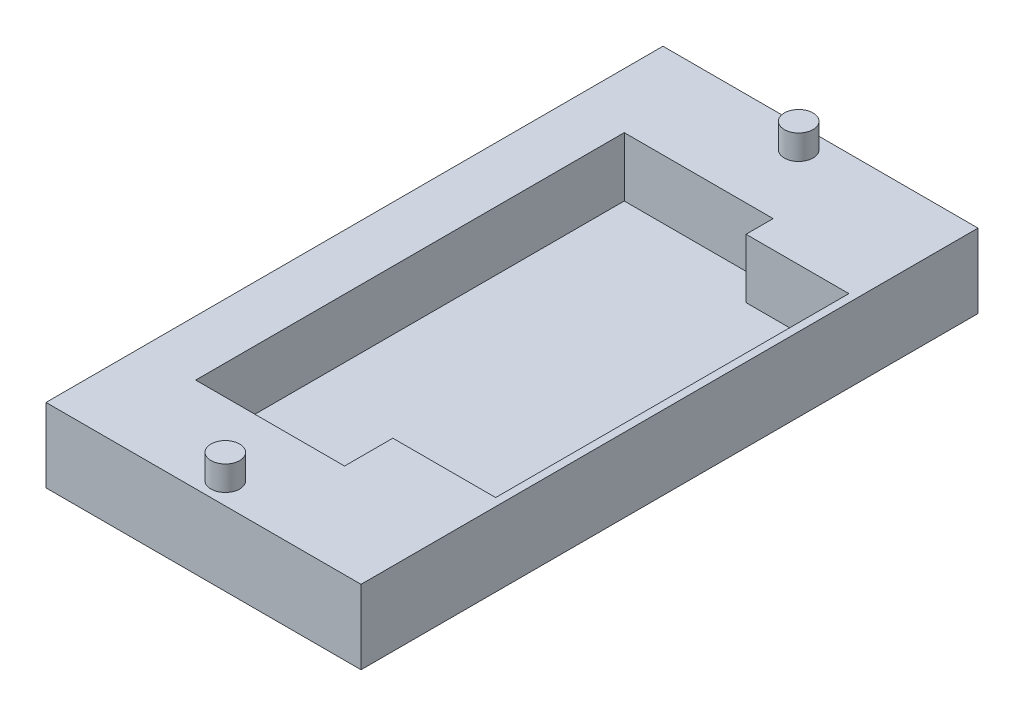
ISO-10303-21;
HEADER;
FILE_DESCRIPTION(('STEP AP214'),'2;1');
FILE_NAME('part.step','',(''),(''),'','','');
FILE_SCHEMA(('AUTOMOTIVE_DESIGN { 1 0 10303 214 1 1 1 1 }'));
ENDSEC;
DATA;
#1=APPLICATION_CONTEXT('core data for automotive mechanical design processes');
#2=APPLICATION_PROTOCOL_DEFINITION('international standard','automotive_design',2000,#1);
#3=PRODUCT_CONTEXT('',#1,'mechanical');
#4=PRODUCT('Part','Part','',(#3));
#5=PRODUCT_RELATED_PRODUCT_CATEGORY('part','',(#4));
#6=PRODUCT_DEFINITION_FORMATION('','',#4);
#7=PRODUCT_DEFINITION_CONTEXT('part definition',#1,'design');
#8=PRODUCT_DEFINITION('design','',#6,#7);
#9=PRODUCT_DEFINITION_SHAPE('','',#8);
#10=(LENGTH_UNIT() NAMED_UNIT(*) SI_UNIT(.MILLI.,.METRE.));
#11=(NAMED_UNIT(*) PLANE_ANGLE_UNIT() SI_UNIT($,.RADIAN.));
#12=(NAMED_UNIT(*) SI_UNIT($,.STERADIAN.) SOLID_ANGLE_UNIT());
#13=UNCERTAINTY_MEASURE_WITH_UNIT(LENGTH_MEASURE(1.E-05),#10,'distance_accuracy_value','');
#14=(GEOMETRIC_REPRESENTATION_CONTEXT(3) GLOBAL_UNCERTAINTY_ASSIGNED_CONTEXT((#13)) GLOBAL_UNIT_ASSIGNED_CONTEXT((#10,
#11,#12)) REPRESENTATION_CONTEXT('',''));
#15=CARTESIAN_POINT('',(0.,0.,0.));
#16=DIRECTION('',(0.,0.,1.));
#17=DIRECTION('',(1.,0.,0.));
#18=AXIS2_PLACEMENT_3D('',#15,#16,#17);
#19=CARTESIAN_POINT('',(22.5,9.,37.5));
#20=DIRECTION('',(0.,0.,-1.));
#21=DIRECTION('',(-1.,0.,0.));
#22=AXIS2_PLACEMENT_3D('',#19,#20,#21);
#23=PLANE('',#22);
#24=DIRECTION('',(1.,0.,0.));
#25=VECTOR('',#24,1.);
#26=CARTESIAN_POINT('',(22.5,9.,37.5));
#27=LINE('',#26,#25);
#28=CARTESIAN_POINT('',(-15.79562908,9.,37.5));
#29=VERTEX_POINT('',#28);
#30=CARTESIAN_POINT('',(22.5,9.,37.5));
#31=VERTEX_POINT('',#30);
#32=EDGE_CURVE('E133',#29,#31,#27,.T.);
#33=ORIENTED_EDGE('',*,*,#32,.F.);
#34=DIRECTION('',(0.,1.,0.));
#35=VECTOR('',#34,1.);
#36=CARTESIAN_POINT('',(-15.79562908,0.,37.5));
#37=LINE('',#36,#35);
#38=CARTESIAN_POINT('',(-15.79562908,0.,37.5));
#39=VERTEX_POINT('',#38);
#40=EDGE_CURVE('E120',#39,#29,#37,.T.);
#41=ORIENTED_EDGE('',*,*,#40,.F.);
#42=DIRECTION('',(1.,0.,0.));
#43=VECTOR('',#42,1.);
#44=CARTESIAN_POINT('',(22.5,0.,37.5));
#45=LINE('',#44,#43);
#46=CARTESIAN_POINT('',(22.5,0.,37.5));
#47=VERTEX_POINT('',#46);
#48=EDGE_CURVE('E131',#39,#47,#45,.T.);
#49=ORIENTED_EDGE('',*,*,#48,.T.);
#50=DIRECTION('',(0.,-1.,0.));
#51=VECTOR('',#50,1.);
#52=CARTESIAN_POINT('',(22.5,9.,37.5));
#53=LINE('',#52,#51);
#54=EDGE_CURVE('E152',#31,#47,#53,.T.);
#55=ORIENTED_EDGE('',*,*,#54,.F.);
#56=EDGE_LOOP('',(#33,#41,#49,#55));
#57=FACE_BOUND('',#56,.T.);
#58=ADVANCED_FACE('F32',(#57),#23,.F.);
#59=CARTESIAN_POINT('',(22.5,9.,-37.5));
#60=DIRECTION('',(-1.,0.,0.));
#61=DIRECTION('',(0.,0.,1.));
#62=AXIS2_PLACEMENT_3D('',#59,#60,#61);
#63=PLANE('',#62);
#64=DIRECTION('',(0.,0.,-1.));
#65=VECTOR('',#64,1.);
#66=CARTESIAN_POINT('',(22.5,0.,-37.5));
#67=LINE('',#66,#65);
#68=CARTESIAN_POINT('',(22.5,0.,-37.5));
#69=VERTEX_POINT('',#68);
#70=EDGE_CURVE('E137',#47,#69,#67,.T.);
#71=ORIENTED_EDGE('',*,*,#70,.T.);
#72=DIRECTION('',(0.,-1.,0.));
#73=VECTOR('',#72,1.);
#74=CARTESIAN_POINT('',(22.5,9.,-37.5));
#75=LINE('',#74,#73);
#76=CARTESIAN_POINT('',(22.5,9.,-37.5));
#77=VERTEX_POINT('',#76);
#78=EDGE_CURVE('E149',#77,#69,#75,.T.);
#79=ORIENTED_EDGE('',*,*,#78,.F.);
#80=DIRECTION('',(0.,0.,-1.));
#81=VECTOR('',#80,1.);
#82=CARTESIAN_POINT('',(22.5,9.,-37.5));
#83=LINE('',#82,#81);
#84=EDGE_CURVE('E172',#31,#77,#83,.T.);
#85=ORIENTED_EDGE('',*,*,#84,.F.);
#86=ORIENTED_EDGE('',*,*,#54,.T.);
#87=EDGE_LOOP('',(#71,#79,#85,#86));
#88=FACE_BOUND('',#87,.T.);
#89=ADVANCED_FACE('F250',(#88),#63,.F.);
#90=CARTESIAN_POINT('',(22.5,9.,-37.5));
#91=DIRECTION('',(0.,0.,1.));
#92=DIRECTION('',(1.,0.,0.));
#93=AXIS2_PLACEMENT_3D('',#90,#91,#92);
#94=PLANE('',#93);
#95=DIRECTION('',(-1.,0.,0.));
#96=VECTOR('',#95,1.);
#97=CARTESIAN_POINT('',(22.5,0.,-37.5));
#98=LINE('',#97,#96);
#99=CARTESIAN_POINT('',(-15.79562908,0.,-37.5));
#100=VERTEX_POINT('',#99);
#101=EDGE_CURVE('E140',#69,#100,#98,.T.);
#102=ORIENTED_EDGE('',*,*,#101,.T.);
#103=DIRECTION('',(0.,1.,0.));
#104=VECTOR('',#103,1.);
#105=CARTESIAN_POINT('',(-15.79562908,0.,-37.5));
#106=LINE('',#105,#104);
#107=CARTESIAN_POINT('',(-15.79562908,9.,-37.5));
#108=VERTEX_POINT('',#107);
#109=EDGE_CURVE('E46',#100,#108,#106,.T.);
#110=ORIENTED_EDGE('',*,*,#109,.T.);
#111=DIRECTION('',(-1.,0.,0.));
#112=VECTOR('',#111,1.);
#113=CARTESIAN_POINT('',(22.5,9.,-37.5));
#114=LINE('',#113,#112);
#115=EDGE_CURVE('E145',#77,#108,#114,.T.);
#116=ORIENTED_EDGE('',*,*,#115,.F.);
#117=ORIENTED_EDGE('',*,*,#78,.T.);
#118=EDGE_LOOP('',(#102,#110,#116,#117));
#119=FACE_BOUND('',#118,.T.);
#120=ADVANCED_FACE('F161',(#119),#94,.F.);
#121=CARTESIAN_POINT('',(0.,9.,0.));
#122=DIRECTION('',(0.,-1.,0.));
#123=DIRECTION('',(0.,0.,-1.));
#124=AXIS2_PLACEMENT_3D('',#121,#122,#123);
#125=PLANE('',#124);
#126=CARTESIAN_POINT('',(3.35218546000001,9.,-34.85));
#127=DIRECTION('',(0.,-1.,0.));
#128=DIRECTION('',(0.,0.,-1.));
#129=AXIS2_PLACEMENT_3D('',#126,#127,#128);
#130=CIRCLE('',#129,1.75);
#131=CARTESIAN_POINT('',(3.35218546000001,9.,-36.6));
#132=VERTEX_POINT('',#131);
#133=EDGE_CURVE('E11',#132,#132,#130,.F.);
#134=ORIENTED_EDGE('',*,*,#133,.F.);
#135=EDGE_LOOP('',(#134));
#136=FACE_BOUND('',#135,.T.);
#137=CARTESIAN_POINT('',(3.35218546000001,9.,34.85));
#138=DIRECTION('',(0.,-1.,0.));
#139=DIRECTION('',(0.,0.,-1.));
#140=AXIS2_PLACEMENT_3D('',#137,#138,#139);
#141=CIRCLE('',#140,1.745);
#142=CARTESIAN_POINT('',(3.35218546000001,9.,33.105));
#143=VERTEX_POINT('',#142);
#144=EDGE_CURVE('E39',#143,#143,#141,.F.);
#145=ORIENTED_EDGE('',*,*,#144,.F.);
#146=EDGE_LOOP('',(#145));
#147=FACE_BOUND('',#146,.T.);
#148=DIRECTION('',(0.,0.,1.));
#149=VECTOR('',#148,1.);
#150=CARTESIAN_POINT('',(-9.05,9.,0.));
#151=LINE('',#150,#149);
#152=CARTESIAN_POINT('',(-9.05,9.,-26.05));
#153=VERTEX_POINT('',#152);
#154=CARTESIAN_POINT('',(-9.05,9.,26.05));
#155=VERTEX_POINT('',#154);
#156=EDGE_CURVE('E168',#153,#155,#151,.T.);
#157=ORIENTED_EDGE('',*,*,#156,.F.);
#158=DIRECTION('',(-1.,0.,0.));
#159=VECTOR('',#158,1.);
#160=CARTESIAN_POINT('',(0.,9.,-26.05));
#161=LINE('',#160,#159);
#162=CARTESIAN_POINT('',(9.05,9.,-26.05));
#163=VERTEX_POINT('',#162);
#164=EDGE_CURVE('E54',#163,#153,#161,.T.);
#165=ORIENTED_EDGE('',*,*,#164,.F.);
#166=DIRECTION('',(0.,0.,1.));
#167=VECTOR('',#166,1.);
#168=CARTESIAN_POINT('',(9.05,9.,0.));
#169=LINE('',#168,#167);
#170=CARTESIAN_POINT('',(9.05,9.,-22.7544100936888));
#171=VERTEX_POINT('',#170);
#172=EDGE_CURVE('E194',#163,#171,#169,.T.);
#173=ORIENTED_EDGE('',*,*,#172,.T.);
#174=DIRECTION('',(1.,0.,0.));
#175=VECTOR('',#174,1.);
#176=CARTESIAN_POINT('',(0.,9.,-22.7544100936888));
#177=LINE('',#176,#175);
#178=CARTESIAN_POINT('',(21.55,9.,-22.7544100936888));
#179=VERTEX_POINT('',#178);
#180=EDGE_CURVE('E191',#171,#179,#177,.T.);
#181=ORIENTED_EDGE('',*,*,#180,.T.);
#182=DIRECTION('',(0.,0.,1.));
#183=VECTOR('',#182,1.);
#184=CARTESIAN_POINT('',(21.55,9.,0.));
#185=LINE('',#184,#183);
#186=CARTESIAN_POINT('',(21.55,9.,20.1845414113188));
#187=VERTEX_POINT('',#186);
#188=EDGE_CURVE('E195',#179,#187,#185,.T.);
#189=ORIENTED_EDGE('',*,*,#188,.T.);
#190=DIRECTION('',(1.,0.,0.));
#191=VECTOR('',#190,1.);
#192=CARTESIAN_POINT('',(0.,9.,20.1845414113188));
#193=LINE('',#192,#191);
#194=CARTESIAN_POINT('',(9.05000000000001,9.,20.1845414113188));
#195=VERTEX_POINT('',#194);
#196=EDGE_CURVE('E198',#195,#187,#193,.T.);
#197=ORIENTED_EDGE('',*,*,#196,.F.);
#198=CARTESIAN_POINT('',(9.05000000000001,9.,26.05));
#199=VERTEX_POINT('',#198);
#200=EDGE_CURVE('E201',#195,#199,#169,.T.);
#201=ORIENTED_EDGE('',*,*,#200,.T.);
#202=DIRECTION('',(-1.,0.,0.));
#203=VECTOR('',#202,1.);
#204=CARTESIAN_POINT('',(0.,9.,26.05));
#205=LINE('',#204,#203);
#206=EDGE_CURVE('E204',#199,#155,#205,.T.);
#207=ORIENTED_EDGE('',*,*,#206,.T.);
#208=EDGE_LOOP('',(#157,#165,#173,#181,#189,#197,#201,#207));
#209=FACE_BOUND('',#208,.T.);
#210=ORIENTED_EDGE('',*,*,#115,.T.);
#211=DIRECTION('',(0.,0.,-1.));
#212=VECTOR('',#211,1.);
#213=CARTESIAN_POINT('',(-15.79562908,9.,-37.5));
#214=LINE('',#213,#212);
#215=EDGE_CURVE('E126',#29,#108,#214,.T.);
#216=ORIENTED_EDGE('',*,*,#215,.F.);
#217=ORIENTED_EDGE('',*,*,#32,.T.);
#218=ORIENTED_EDGE('',*,*,#84,.T.);
#219=EDGE_LOOP('',(#210,#216,#217,#218));
#220=FACE_BOUND('',#219,.T.);
#221=ADVANCED_FACE('F158',(#136,#147,#209,#220),#125,.F.);
#222=CARTESIAN_POINT('',(0.,0.,0.));
#223=DIRECTION('',(0.,-1.,0.));
#224=DIRECTION('',(0.,0.,-1.));
#225=AXIS2_PLACEMENT_3D('',#222,#223,#224);
#226=PLANE('',#225);
#227=DIRECTION('',(0.,0.,-1.));
#228=VECTOR('',#227,1.);
#229=CARTESIAN_POINT('',(-15.79562908,0.,-37.5));
#230=LINE('',#229,#228);
#231=EDGE_CURVE('E117',#39,#100,#230,.T.);
#232=ORIENTED_EDGE('',*,*,#231,.T.);
#233=ORIENTED_EDGE('',*,*,#101,.F.);
#234=ORIENTED_EDGE('',*,*,#70,.F.);
#235=ORIENTED_EDGE('',*,*,#48,.F.);
#236=EDGE_LOOP('',(#232,#233,#234,#235));
#237=FACE_BOUND('',#236,.T.);
#238=ADVANCED_FACE('F136',(#237),#226,.T.);
#239=CARTESIAN_POINT('',(0.,1.8,-26.05));
#240=DIRECTION('',(0.,0.,-1.));
#241=DIRECTION('',(-1.,0.,0.));
#242=AXIS2_PLACEMENT_3D('',#239,#240,#241);
#243=PLANE('',#242);
#244=ORIENTED_EDGE('',*,*,#164,.T.);
#245=DIRECTION('',(0.,1.,0.));
#246=VECTOR('',#245,1.);
#247=CARTESIAN_POINT('',(-9.05,1.8,-26.05));
#248=LINE('',#247,#246);
#249=CARTESIAN_POINT('',(-9.05,1.8,-26.05));
#250=VERTEX_POINT('',#249);
#251=EDGE_CURVE('E177',#250,#153,#248,.T.);
#252=ORIENTED_EDGE('',*,*,#251,.F.);
#253=DIRECTION('',(-1.,0.,0.));
#254=VECTOR('',#253,1.);
#255=CARTESIAN_POINT('',(0.,1.8,-26.05));
#256=LINE('',#255,#254);
#257=CARTESIAN_POINT('',(9.05,1.8,-26.05));
#258=VERTEX_POINT('',#257);
#259=EDGE_CURVE('E222',#258,#250,#256,.T.);
#260=ORIENTED_EDGE('',*,*,#259,.F.);
#261=DIRECTION('',(0.,1.,0.));
#262=VECTOR('',#261,1.);
#263=CARTESIAN_POINT('',(9.05,1.8,-26.05));
#264=LINE('',#263,#262);
#265=EDGE_CURVE('E138',#258,#163,#264,.T.);
#266=ORIENTED_EDGE('',*,*,#265,.T.);
#267=EDGE_LOOP('',(#244,#252,#260,#266));
#268=FACE_BOUND('',#267,.T.);
#269=ADVANCED_FACE('F261',(#268),#243,.F.);
#270=CARTESIAN_POINT('',(9.05,1.8,0.));
#271=DIRECTION('',(-1.,0.,0.));
#272=DIRECTION('',(0.,0.,1.));
#273=AXIS2_PLACEMENT_3D('',#270,#271,#272);
#274=PLANE('',#273);
#275=ORIENTED_EDGE('',*,*,#172,.F.);
#276=ORIENTED_EDGE('',*,*,#265,.F.);
#277=DIRECTION('',(0.,0.,1.));
#278=VECTOR('',#277,1.);
#279=CARTESIAN_POINT('',(9.05,1.8,0.));
#280=LINE('',#279,#278);
#281=CARTESIAN_POINT('',(9.05,1.8,-22.7544100936888));
#282=VERTEX_POINT('',#281);
#283=EDGE_CURVE('E180',#258,#282,#280,.T.);
#284=ORIENTED_EDGE('',*,*,#283,.T.);
#285=DIRECTION('',(0.,1.,0.));
#286=VECTOR('',#285,1.);
#287=CARTESIAN_POINT('',(9.05,1.8,-22.7544100936888));
#288=LINE('',#287,#286);
#289=EDGE_CURVE('E142',#282,#171,#288,.T.);
#290=ORIENTED_EDGE('',*,*,#289,.T.);
#291=EDGE_LOOP('',(#275,#276,#284,#290));
#292=FACE_BOUND('',#291,.T.);
#293=ADVANCED_FACE('F265',(#292),#274,.T.);
#294=CARTESIAN_POINT('',(0.,1.8,-22.7544100936888));
#295=DIRECTION('',(0.,0.,1.));
#296=DIRECTION('',(1.,0.,0.));
#297=AXIS2_PLACEMENT_3D('',#294,#295,#296);
#298=PLANE('',#297);
#299=ORIENTED_EDGE('',*,*,#180,.F.);
#300=ORIENTED_EDGE('',*,*,#289,.F.);
#301=DIRECTION('',(1.,0.,0.));
#302=VECTOR('',#301,1.);
#303=CARTESIAN_POINT('',(0.,1.8,-22.7544100936888));
#304=LINE('',#303,#302);
#305=CARTESIAN_POINT('',(21.55,1.8,-22.7544100936888));
#306=VERTEX_POINT('',#305);
#307=EDGE_CURVE('E208',#282,#306,#304,.T.);
#308=ORIENTED_EDGE('',*,*,#307,.T.);
#309=DIRECTION('',(0.,1.,0.));
#310=VECTOR('',#309,1.);
#311=CARTESIAN_POINT('',(21.55,1.8,-22.7544100936888));
#312=LINE('',#311,#310);
#313=EDGE_CURVE('E188',#306,#179,#312,.T.);
#314=ORIENTED_EDGE('',*,*,#313,.T.);
#315=EDGE_LOOP('',(#299,#300,#308,#314));
#316=FACE_BOUND('',#315,.T.);
#317=ADVANCED_FACE('F283',(#316),#298,.T.);
#318=CARTESIAN_POINT('',(21.55,1.8,0.));
#319=DIRECTION('',(-1.,0.,0.));
#320=DIRECTION('',(0.,0.,1.));
#321=AXIS2_PLACEMENT_3D('',#318,#319,#320);
#322=PLANE('',#321);
#323=ORIENTED_EDGE('',*,*,#188,.F.);
#324=ORIENTED_EDGE('',*,*,#313,.F.);
#325=DIRECTION('',(0.,0.,1.));
#326=VECTOR('',#325,1.);
#327=CARTESIAN_POINT('',(21.55,1.8,0.));
#328=LINE('',#327,#326);
#329=CARTESIAN_POINT('',(21.55,1.8,20.1845414113188));
#330=VERTEX_POINT('',#329);
#331=EDGE_CURVE('E210',#306,#330,#328,.T.);
#332=ORIENTED_EDGE('',*,*,#331,.T.);
#333=DIRECTION('',(0.,1.,0.));
#334=VECTOR('',#333,1.);
#335=CARTESIAN_POINT('',(21.55,1.8,20.1845414113188));
#336=LINE('',#335,#334);
#337=EDGE_CURVE('E186',#330,#187,#336,.T.);
#338=ORIENTED_EDGE('',*,*,#337,.T.);
#339=EDGE_LOOP('',(#323,#324,#332,#338));
#340=FACE_BOUND('',#339,.T.);
#341=ADVANCED_FACE('F279',(#340),#322,.T.);
#342=CARTESIAN_POINT('',(0.,1.8,20.1845414113188));
#343=DIRECTION('',(0.,0.,1.));
#344=DIRECTION('',(1.,0.,0.));
#345=AXIS2_PLACEMENT_3D('',#342,#343,#344);
#346=PLANE('',#345);
#347=ORIENTED_EDGE('',*,*,#196,.T.);
#348=ORIENTED_EDGE('',*,*,#337,.F.);
#349=DIRECTION('',(1.,0.,0.));
#350=VECTOR('',#349,1.);
#351=CARTESIAN_POINT('',(0.,1.8,20.1845414113188));
#352=LINE('',#351,#350);
#353=CARTESIAN_POINT('',(9.05000000000001,1.8,20.1845414113188));
#354=VERTEX_POINT('',#353);
#355=EDGE_CURVE('E212',#354,#330,#352,.T.);
#356=ORIENTED_EDGE('',*,*,#355,.F.);
#357=DIRECTION('',(0.,1.,0.));
#358=VECTOR('',#357,1.);
#359=CARTESIAN_POINT('',(9.05000000000001,1.8,20.1845414113188));
#360=LINE('',#359,#358);
#361=EDGE_CURVE('E184',#354,#195,#360,.T.);
#362=ORIENTED_EDGE('',*,*,#361,.T.);
#363=EDGE_LOOP('',(#347,#348,#356,#362));
#364=FACE_BOUND('',#363,.T.);
#365=ADVANCED_FACE('F276',(#364),#346,.F.);
#366=ORIENTED_EDGE('',*,*,#200,.F.);
#367=ORIENTED_EDGE('',*,*,#361,.F.);
#368=CARTESIAN_POINT('',(9.05000000000001,1.8,26.05));
#369=VERTEX_POINT('',#368);
#370=EDGE_CURVE('E215',#354,#369,#280,.T.);
#371=ORIENTED_EDGE('',*,*,#370,.T.);
#372=DIRECTION('',(0.,1.,0.));
#373=VECTOR('',#372,1.);
#374=CARTESIAN_POINT('',(9.05000000000001,1.8,26.05));
#375=LINE('',#374,#373);
#376=EDGE_CURVE('E182',#369,#199,#375,.T.);
#377=ORIENTED_EDGE('',*,*,#376,.T.);
#378=EDGE_LOOP('',(#366,#367,#371,#377));
#379=FACE_BOUND('',#378,.T.);
#380=ADVANCED_FACE('F274',(#379),#274,.T.);
#381=CARTESIAN_POINT('',(0.,1.8,26.05));
#382=DIRECTION('',(0.,0.,-1.));
#383=DIRECTION('',(-1.,0.,0.));
#384=AXIS2_PLACEMENT_3D('',#381,#382,#383);
#385=PLANE('',#384);
#386=ORIENTED_EDGE('',*,*,#206,.F.);
#387=ORIENTED_EDGE('',*,*,#376,.F.);
#388=DIRECTION('',(-1.,0.,0.));
#389=VECTOR('',#388,1.);
#390=CARTESIAN_POINT('',(0.,1.8,26.05));
#391=LINE('',#390,#389);
#392=CARTESIAN_POINT('',(-9.05,1.8,26.05));
#393=VERTEX_POINT('',#392);
#394=EDGE_CURVE('E217',#369,#393,#391,.T.);
#395=ORIENTED_EDGE('',*,*,#394,.T.);
#396=DIRECTION('',(0.,1.,0.));
#397=VECTOR('',#396,1.);
#398=CARTESIAN_POINT('',(-9.05,1.8,26.05));
#399=LINE('',#398,#397);
#400=EDGE_CURVE('E179',#393,#155,#399,.T.);
#401=ORIENTED_EDGE('',*,*,#400,.T.);
#402=EDGE_LOOP('',(#386,#387,#395,#401));
#403=FACE_BOUND('',#402,.T.);
#404=ADVANCED_FACE('F270',(#403),#385,.T.);
#405=CARTESIAN_POINT('',(-9.05,1.8,0.));
#406=DIRECTION('',(-1.,0.,0.));
#407=DIRECTION('',(0.,0.,1.));
#408=AXIS2_PLACEMENT_3D('',#405,#406,#407);
#409=PLANE('',#408);
#410=ORIENTED_EDGE('',*,*,#156,.T.);
#411=ORIENTED_EDGE('',*,*,#400,.F.);
#412=DIRECTION('',(0.,0.,1.));
#413=VECTOR('',#412,1.);
#414=CARTESIAN_POINT('',(-9.05,1.8,0.));
#415=LINE('',#414,#413);
#416=EDGE_CURVE('E219',#250,#393,#415,.T.);
#417=ORIENTED_EDGE('',*,*,#416,.F.);
#418=ORIENTED_EDGE('',*,*,#251,.T.);
#419=EDGE_LOOP('',(#410,#411,#417,#418));
#420=FACE_BOUND('',#419,.T.);
#421=ADVANCED_FACE('F266',(#420),#409,.F.);
#422=CARTESIAN_POINT('',(0.,1.8,0.));
#423=DIRECTION('',(0.,1.,0.));
#424=DIRECTION('',(0.,0.,1.));
#425=AXIS2_PLACEMENT_3D('',#422,#423,#424);
#426=PLANE('',#425);
#427=ORIENTED_EDGE('',*,*,#259,.T.);
#428=ORIENTED_EDGE('',*,*,#416,.T.);
#429=ORIENTED_EDGE('',*,*,#394,.F.);
#430=ORIENTED_EDGE('',*,*,#370,.F.);
#431=ORIENTED_EDGE('',*,*,#355,.T.);
#432=ORIENTED_EDGE('',*,*,#331,.F.);
#433=ORIENTED_EDGE('',*,*,#307,.F.);
#434=ORIENTED_EDGE('',*,*,#283,.F.);
#435=EDGE_LOOP('',(#427,#428,#429,#430,#431,#432,#433,#434));
#436=FACE_BOUND('',#435,.T.);
#437=ADVANCED_FACE('F269',(#436),#426,.T.);
#438=CARTESIAN_POINT('',(-15.79562908,0.,-37.5));
#439=DIRECTION('',(1.,0.,0.));
#440=DIRECTION('',(0.,0.,-1.));
#441=AXIS2_PLACEMENT_3D('',#438,#439,#440);
#442=PLANE('',#441);
#443=ORIENTED_EDGE('',*,*,#215,.T.);
#444=ORIENTED_EDGE('',*,*,#109,.F.);
#445=ORIENTED_EDGE('',*,*,#231,.F.);
#446=ORIENTED_EDGE('',*,*,#40,.T.);
#447=EDGE_LOOP('',(#443,#444,#445,#446));
#448=FACE_BOUND('',#447,.T.);
#449=ADVANCED_FACE('F119',(#448),#442,.F.);
#450=CARTESIAN_POINT('',(3.35218546000001,12.,34.85));
#451=DIRECTION('',(0.,-1.,0.));
#452=DIRECTION('',(0.,0.,-1.));
#453=AXIS2_PLACEMENT_3D('',#450,#451,#452);
#454=CYLINDRICAL_SURFACE('',#453,1.745);
#455=CARTESIAN_POINT('',(3.35218546000001,12.,34.85));
#456=DIRECTION('',(0.,1.,0.));
#457=DIRECTION('',(0.,0.,1.));
#458=AXIS2_PLACEMENT_3D('',#455,#456,#457);
#459=CIRCLE('',#458,1.745);
#460=CARTESIAN_POINT('',(3.35218546000001,12.,36.595));
#461=VERTEX_POINT('',#460);
#462=EDGE_CURVE('E226',#461,#461,#459,.T.);
#463=ORIENTED_EDGE('',*,*,#462,.F.);
#464=EDGE_LOOP('',(#463));
#465=FACE_BOUND('',#464,.T.);
#466=ORIENTED_EDGE('',*,*,#144,.T.);
#467=EDGE_LOOP('',(#466));
#468=FACE_BOUND('',#467,.T.);
#469=ADVANCED_FACE('F156',(#465,#468),#454,.T.);
#470=CARTESIAN_POINT('',(3.35218546000001,12.,34.85));
#471=DIRECTION('',(0.,1.,0.));
#472=DIRECTION('',(0.,0.,1.));
#473=AXIS2_PLACEMENT_3D('',#470,#471,#472);
#474=PLANE('',#473);
#475=ORIENTED_EDGE('',*,*,#462,.T.);
#476=EDGE_LOOP('',(#475));
#477=FACE_BOUND('',#476,.T.);
#478=ADVANCED_FACE('F239',(#477),#474,.T.);
#479=CARTESIAN_POINT('',(3.35218546000001,12.,-34.85));
#480=DIRECTION('',(0.,-1.,0.));
#481=DIRECTION('',(0.,0.,-1.));
#482=AXIS2_PLACEMENT_3D('',#479,#480,#481);
#483=CYLINDRICAL_SURFACE('',#482,1.75);
#484=CARTESIAN_POINT('',(3.35218546000001,12.,-34.85));
#485=DIRECTION('',(0.,1.,0.));
#486=DIRECTION('',(0.,0.,1.));
#487=AXIS2_PLACEMENT_3D('',#484,#485,#486);
#488=CIRCLE('',#487,1.75);
#489=CARTESIAN_POINT('',(3.35218546000001,12.,-33.1));
#490=VERTEX_POINT('',#489);
#491=EDGE_CURVE('E230',#490,#490,#488,.T.);
#492=ORIENTED_EDGE('',*,*,#491,.F.);
#493=EDGE_LOOP('',(#492));
#494=FACE_BOUND('',#493,.T.);
#495=ORIENTED_EDGE('',*,*,#133,.T.);
#496=EDGE_LOOP('',(#495));
#497=FACE_BOUND('',#496,.T.);
#498=ADVANCED_FACE('F236',(#494,#497),#483,.T.);
#499=CARTESIAN_POINT('',(3.35218546000001,12.,-34.85));
#500=DIRECTION('',(0.,1.,0.));
#501=DIRECTION('',(0.,0.,1.));
#502=AXIS2_PLACEMENT_3D('',#499,#500,#501);
#503=PLANE('',#502);
#504=ORIENTED_EDGE('',*,*,#491,.T.);
#505=EDGE_LOOP('',(#504));
#506=FACE_BOUND('',#505,.T.);
#507=ADVANCED_FACE('F234',(#506),#503,.T.);
#508=CLOSED_SHELL('',(#58,#89,#120,#221,#238,#269,#293,#317,#341,#365,#380,#404,#421,#437,#449,
#469,#478,#498,#507));
#509=MANIFOLD_SOLID_BREP('B2',#508);
#510=ADVANCED_BREP_SHAPE_REPRESENTATION('',(#18,#509),#14);
#511=SHAPE_DEFINITION_REPRESENTATION(#9,#510);
ENDSEC;
END-ISO-10303-21;
